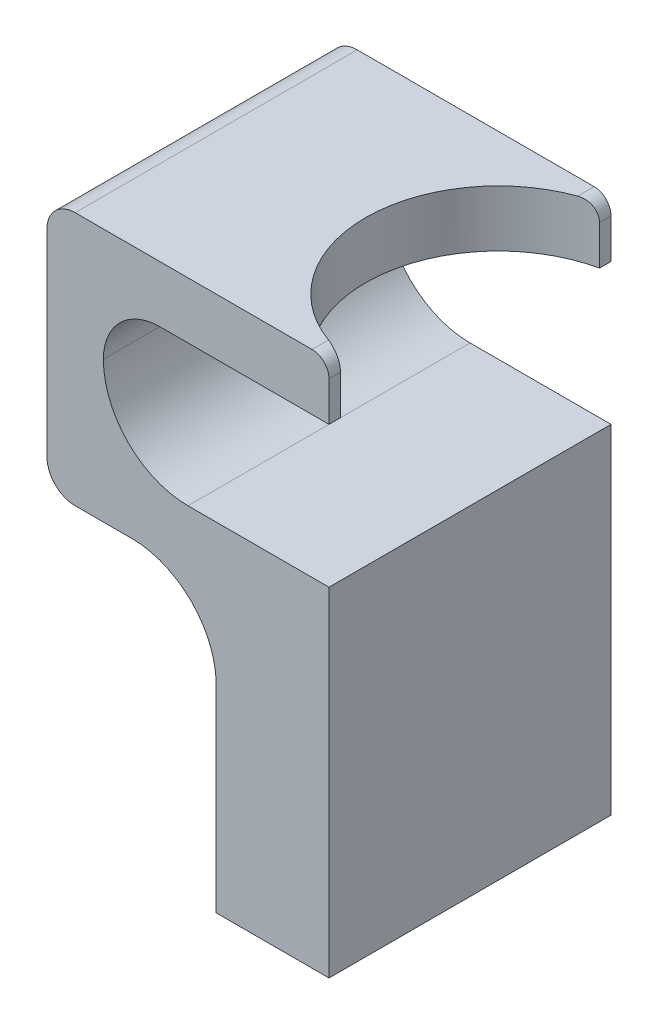
ISO-10303-21;
HEADER;
FILE_DESCRIPTION(('STEP AP214'),'2;1');
FILE_NAME('part.step','',(''),(''),'','','');
FILE_SCHEMA(('AUTOMOTIVE_DESIGN { 1 0 10303 214 1 1 1 1 }'));
ENDSEC;
DATA;
#1=APPLICATION_CONTEXT('core data for automotive mechanical design processes');
#2=APPLICATION_PROTOCOL_DEFINITION('international standard','automotive_design',2000,#1);
#3=PRODUCT_CONTEXT('',#1,'mechanical');
#4=PRODUCT('Part','Part','',(#3));
#5=PRODUCT_RELATED_PRODUCT_CATEGORY('part','',(#4));
#6=PRODUCT_DEFINITION_FORMATION('','',#4);
#7=PRODUCT_DEFINITION_CONTEXT('part definition',#1,'design');
#8=PRODUCT_DEFINITION('design','',#6,#7);
#9=PRODUCT_DEFINITION_SHAPE('','',#8);
#10=(LENGTH_UNIT() NAMED_UNIT(*) SI_UNIT(.MILLI.,.METRE.));
#11=(NAMED_UNIT(*) PLANE_ANGLE_UNIT() SI_UNIT($,.RADIAN.));
#12=(NAMED_UNIT(*) SI_UNIT($,.STERADIAN.) SOLID_ANGLE_UNIT());
#13=UNCERTAINTY_MEASURE_WITH_UNIT(LENGTH_MEASURE(1.E-05),#10,'distance_accuracy_value','');
#14=(GEOMETRIC_REPRESENTATION_CONTEXT(3) GLOBAL_UNCERTAINTY_ASSIGNED_CONTEXT((#13)) GLOBAL_UNIT_ASSIGNED_CONTEXT((#10,
#11,#12)) REPRESENTATION_CONTEXT('',''));
#15=CARTESIAN_POINT('',(0.,0.,0.));
#16=DIRECTION('',(0.,0.,1.));
#17=DIRECTION('',(1.,0.,0.));
#18=AXIS2_PLACEMENT_3D('',#15,#16,#17);
#19=CARTESIAN_POINT('',(20.,85.,50.));
#20=DIRECTION('',(-1.,0.,0.));
#21=DIRECTION('',(0.,0.,1.));
#22=AXIS2_PLACEMENT_3D('',#19,#20,#21);
#23=PLANE('',#22);
#24=DIRECTION('',(0.,1.,0.));
#25=VECTOR('',#24,1.);
#26=CARTESIAN_POINT('',(20.,75.,47.9619250064101));
#27=LINE('',#26,#25);
#28=CARTESIAN_POINT('',(20.,85.,47.9619250064101));
#29=VERTEX_POINT('',#28);
#30=CARTESIAN_POINT('',(20.,92.,47.9619250064101));
#31=VERTEX_POINT('',#30);
#32=EDGE_CURVE('E171',#29,#31,#27,.T.);
#33=ORIENTED_EDGE('',*,*,#32,.T.);
#34=DIRECTION('',(0.,0.,-1.));
#35=VECTOR('',#34,1.);
#36=CARTESIAN_POINT('',(20.,92.,50.));
#37=LINE('',#36,#35);
#38=CARTESIAN_POINT('',(20.,92.,50.));
#39=VERTEX_POINT('',#38);
#40=EDGE_CURVE('E305',#31,#39,#37,.F.);
#41=ORIENTED_EDGE('',*,*,#40,.T.);
#42=DIRECTION('',(0.,1.,0.));
#43=VECTOR('',#42,1.);
#44=CARTESIAN_POINT('',(20.,85.,50.));
#45=LINE('',#44,#43);
#46=CARTESIAN_POINT('',(20.,85.,50.));
#47=VERTEX_POINT('',#46);
#48=EDGE_CURVE('E341',#47,#39,#45,.T.);
#49=ORIENTED_EDGE('',*,*,#48,.F.);
#50=DIRECTION('',(0.,0.,-1.));
#51=VECTOR('',#50,1.);
#52=CARTESIAN_POINT('',(20.,85.,50.));
#53=LINE('',#52,#51);
#54=EDGE_CURVE('E179',#47,#29,#53,.T.);
#55=ORIENTED_EDGE('',*,*,#54,.T.);
#56=EDGE_LOOP('',(#33,#41,#49,#55));
#57=FACE_BOUND('',#56,.T.);
#58=ADVANCED_FACE('F32',(#57),#23,.F.);
#59=CARTESIAN_POINT('',(0.,0.,50.));
#60=DIRECTION('',(0.,1.,0.));
#61=DIRECTION('',(0.,0.,1.));
#62=AXIS2_PLACEMENT_3D('',#59,#60,#61);
#63=PLANE('',#62);
#64=DIRECTION('',(1.,0.,0.));
#65=VECTOR('',#64,1.);
#66=CARTESIAN_POINT('',(0.,0.,0.));
#67=LINE('',#66,#65);
#68=CARTESIAN_POINT('',(0.,0.,0.));
#69=VERTEX_POINT('',#68);
#70=CARTESIAN_POINT('',(20.,0.,0.));
#71=VERTEX_POINT('',#70);
#72=EDGE_CURVE('E307',#69,#71,#67,.T.);
#73=ORIENTED_EDGE('',*,*,#72,.T.);
#74=DIRECTION('',(0.,0.,-1.));
#75=VECTOR('',#74,1.);
#76=CARTESIAN_POINT('',(20.,0.,50.));
#77=LINE('',#76,#75);
#78=CARTESIAN_POINT('',(20.,0.,50.));
#79=VERTEX_POINT('',#78);
#80=EDGE_CURVE('E190',#79,#71,#77,.T.);
#81=ORIENTED_EDGE('',*,*,#80,.F.);
#82=DIRECTION('',(1.,0.,0.));
#83=VECTOR('',#82,1.);
#84=CARTESIAN_POINT('',(0.,0.,50.));
#85=LINE('',#84,#83);
#86=CARTESIAN_POINT('',(0.,0.,50.));
#87=VERTEX_POINT('',#86);
#88=EDGE_CURVE('E376',#87,#79,#85,.T.);
#89=ORIENTED_EDGE('',*,*,#88,.F.);
#90=DIRECTION('',(0.,0.,-1.));
#91=VECTOR('',#90,1.);
#92=CARTESIAN_POINT('',(0.,0.,50.));
#93=LINE('',#92,#91);
#94=EDGE_CURVE('E180',#87,#69,#93,.T.);
#95=ORIENTED_EDGE('',*,*,#94,.T.);
#96=EDGE_LOOP('',(#73,#81,#89,#95));
#97=FACE_BOUND('',#96,.T.);
#98=ADVANCED_FACE('F279',(#97),#63,.F.);
#99=CARTESIAN_POINT('',(20.,0.,50.));
#100=DIRECTION('',(-1.,0.,0.));
#101=DIRECTION('',(0.,0.,1.));
#102=AXIS2_PLACEMENT_3D('',#99,#100,#101);
#103=PLANE('',#102);
#104=DIRECTION('',(0.,1.,0.));
#105=VECTOR('',#104,1.);
#106=CARTESIAN_POINT('',(20.,0.,0.));
#107=LINE('',#106,#105);
#108=CARTESIAN_POINT('',(20.,60.,0.));
#109=VERTEX_POINT('',#108);
#110=EDGE_CURVE('E361',#71,#109,#107,.T.);
#111=ORIENTED_EDGE('',*,*,#110,.T.);
#112=DIRECTION('',(0.,0.,-1.));
#113=VECTOR('',#112,1.);
#114=CARTESIAN_POINT('',(20.,60.,50.));
#115=LINE('',#114,#113);
#116=CARTESIAN_POINT('',(20.,60.,50.));
#117=VERTEX_POINT('',#116);
#118=EDGE_CURVE('E182',#117,#109,#115,.T.);
#119=ORIENTED_EDGE('',*,*,#118,.F.);
#120=DIRECTION('',(0.,1.,0.));
#121=VECTOR('',#120,1.);
#122=CARTESIAN_POINT('',(20.,0.,50.));
#123=LINE('',#122,#121);
#124=EDGE_CURVE('E347',#79,#117,#123,.T.);
#125=ORIENTED_EDGE('',*,*,#124,.F.);
#126=ORIENTED_EDGE('',*,*,#80,.T.);
#127=EDGE_LOOP('',(#111,#119,#125,#126));
#128=FACE_BOUND('',#127,.T.);
#129=ADVANCED_FACE('F275',(#128),#103,.F.);
#130=CARTESIAN_POINT('',(20.,60.,50.));
#131=DIRECTION('',(0.,-1.,0.));
#132=DIRECTION('',(1.,0.,0.));
#133=AXIS2_PLACEMENT_3D('',#130,#131,#132);
#134=PLANE('',#133);
#135=DIRECTION('',(-1.,0.,0.));
#136=VECTOR('',#135,1.);
#137=CARTESIAN_POINT('',(20.,60.,0.));
#138=LINE('',#137,#136);
#139=CARTESIAN_POINT('',(-5.,60.,0.));
#140=VERTEX_POINT('',#139);
#141=EDGE_CURVE('E363',#109,#140,#138,.T.);
#142=ORIENTED_EDGE('',*,*,#141,.T.);
#143=DIRECTION('',(0.,0.,-1.));
#144=VECTOR('',#143,1.);
#145=CARTESIAN_POINT('',(-5.,60.,50.));
#146=LINE('',#145,#144);
#147=CARTESIAN_POINT('',(-5.,60.,50.));
#148=VERTEX_POINT('',#147);
#149=EDGE_CURVE('E198',#140,#148,#146,.F.);
#150=ORIENTED_EDGE('',*,*,#149,.T.);
#151=DIRECTION('',(-1.,0.,0.));
#152=VECTOR('',#151,1.);
#153=CARTESIAN_POINT('',(20.,60.,50.));
#154=LINE('',#153,#152);
#155=EDGE_CURVE('E342',#117,#148,#154,.T.);
#156=ORIENTED_EDGE('',*,*,#155,.F.);
#157=ORIENTED_EDGE('',*,*,#118,.T.);
#158=EDGE_LOOP('',(#142,#150,#156,#157));
#159=FACE_BOUND('',#158,.T.);
#160=ADVANCED_FACE('F272',(#159),#134,.F.);
#161=CARTESIAN_POINT('',(-20.,85.,50.));
#162=DIRECTION('',(0.,1.,0.));
#163=DIRECTION('',(0.,0.,1.));
#164=AXIS2_PLACEMENT_3D('',#161,#162,#163);
#165=PLANE('',#164);
#166=DIRECTION('',(1.,0.,0.));
#167=VECTOR('',#166,1.);
#168=CARTESIAN_POINT('',(-20.,85.,50.));
#169=LINE('',#168,#167);
#170=CARTESIAN_POINT('',(-10.,85.,50.));
#171=VERTEX_POINT('',#170);
#172=EDGE_CURVE('E340',#171,#47,#169,.T.);
#173=ORIENTED_EDGE('',*,*,#172,.F.);
#174=DIRECTION('',(0.,0.,-1.));
#175=VECTOR('',#174,1.);
#176=CARTESIAN_POINT('',(-10.,85.,0.));
#177=LINE('',#176,#175);
#178=CARTESIAN_POINT('',(-10.,85.,0.));
#179=VERTEX_POINT('',#178);
#180=EDGE_CURVE('E332',#171,#179,#177,.T.);
#181=ORIENTED_EDGE('',*,*,#180,.T.);
#182=DIRECTION('',(1.,0.,0.));
#183=VECTOR('',#182,1.);
#184=CARTESIAN_POINT('',(-20.,85.,0.));
#185=LINE('',#184,#183);
#186=CARTESIAN_POINT('',(20.,85.,0.));
#187=VERTEX_POINT('',#186);
#188=EDGE_CURVE('E178',#179,#187,#185,.T.);
#189=ORIENTED_EDGE('',*,*,#188,.T.);
#190=CARTESIAN_POINT('',(20.,85.,2.03807499358991));
#191=VERTEX_POINT('',#190);
#192=EDGE_CURVE('E160',#191,#187,#53,.T.);
#193=ORIENTED_EDGE('',*,*,#192,.F.);
#194=CARTESIAN_POINT('',(25.,85.,25.));
#195=DIRECTION('',(0.,1.,0.));
#196=DIRECTION('',(0.,0.,1.));
#197=AXIS2_PLACEMENT_3D('',#194,#195,#196);
#198=CIRCLE('',#197,23.5);
#199=EDGE_CURVE('E166',#191,#29,#198,.T.);
#200=ORIENTED_EDGE('',*,*,#199,.T.);
#201=ORIENTED_EDGE('',*,*,#54,.F.);
#202=EDGE_LOOP('',(#173,#181,#189,#193,#200,#201));
#203=FACE_BOUND('',#202,.T.);
#204=ADVANCED_FACE('F176',(#203),#165,.F.);
#205=DIRECTION('',(0.,1.,0.));
#206=VECTOR('',#205,1.);
#207=CARTESIAN_POINT('',(20.,85.,0.));
#208=LINE('',#207,#206);
#209=CARTESIAN_POINT('',(20.,92.,0.));
#210=VERTEX_POINT('',#209);
#211=EDGE_CURVE('E366',#187,#210,#208,.T.);
#212=ORIENTED_EDGE('',*,*,#211,.T.);
#213=DIRECTION('',(0.,0.,-1.));
#214=VECTOR('',#213,1.);
#215=CARTESIAN_POINT('',(20.,92.,50.));
#216=LINE('',#215,#214);
#217=CARTESIAN_POINT('',(20.,92.,2.03807499358991));
#218=VERTEX_POINT('',#217);
#219=EDGE_CURVE('E163',#210,#218,#216,.F.);
#220=ORIENTED_EDGE('',*,*,#219,.T.);
#221=DIRECTION('',(0.,1.,0.));
#222=VECTOR('',#221,1.);
#223=CARTESIAN_POINT('',(20.,75.,2.03807499358991));
#224=LINE('',#223,#222);
#225=EDGE_CURVE('E155',#218,#191,#224,.F.);
#226=ORIENTED_EDGE('',*,*,#225,.T.);
#227=ORIENTED_EDGE('',*,*,#192,.T.);
#228=EDGE_LOOP('',(#212,#220,#226,#227));
#229=FACE_BOUND('',#228,.T.);
#230=ADVANCED_FACE('F158',(#229),#23,.F.);
#231=CARTESIAN_POINT('',(20.,95.,50.));
#232=DIRECTION('',(0.,-1.,0.));
#233=DIRECTION('',(0.,0.,-1.));
#234=AXIS2_PLACEMENT_3D('',#231,#232,#233);
#235=PLANE('',#234);
#236=DIRECTION('',(-1.,0.,0.));
#237=VECTOR('',#236,1.);
#238=CARTESIAN_POINT('',(20.,95.,0.));
#239=LINE('',#238,#237);
#240=CARTESIAN_POINT('',(17.,95.,0.));
#241=VERTEX_POINT('',#240);
#242=CARTESIAN_POINT('',(-25.,95.,0.));
#243=VERTEX_POINT('',#242);
#244=EDGE_CURVE('E368',#241,#243,#239,.T.);
#245=ORIENTED_EDGE('',*,*,#244,.T.);
#246=DIRECTION('',(0.,0.,-1.));
#247=VECTOR('',#246,1.);
#248=CARTESIAN_POINT('',(-25.,95.,50.));
#249=LINE('',#248,#247);
#250=CARTESIAN_POINT('',(-25.,95.,50.));
#251=VERTEX_POINT('',#250);
#252=EDGE_CURVE('E323',#243,#251,#249,.F.);
#253=ORIENTED_EDGE('',*,*,#252,.T.);
#254=DIRECTION('',(-1.,0.,0.));
#255=VECTOR('',#254,1.);
#256=CARTESIAN_POINT('',(20.,95.,50.));
#257=LINE('',#256,#255);
#258=CARTESIAN_POINT('',(17.,95.,50.));
#259=VERTEX_POINT('',#258);
#260=EDGE_CURVE('E344',#259,#251,#257,.T.);
#261=ORIENTED_EDGE('',*,*,#260,.F.);
#262=DIRECTION('',(0.,0.,-1.));
#263=VECTOR('',#262,1.);
#264=CARTESIAN_POINT('',(17.,95.,50.));
#265=LINE('',#264,#263);
#266=CARTESIAN_POINT('',(17.,95.,47.0963797939844));
#267=VERTEX_POINT('',#266);
#268=EDGE_CURVE('E215',#259,#267,#265,.T.);
#269=ORIENTED_EDGE('',*,*,#268,.T.);
#270=CARTESIAN_POINT('',(25.,95.,25.));
#271=DIRECTION('',(0.,-1.,0.));
#272=DIRECTION('',(0.,0.,-1.));
#273=AXIS2_PLACEMENT_3D('',#270,#271,#272);
#274=CIRCLE('',#273,23.5);
#275=CARTESIAN_POINT('',(17.,95.,2.90362020601562));
#276=VERTEX_POINT('',#275);
#277=EDGE_CURVE('E193',#267,#276,#274,.T.);
#278=ORIENTED_EDGE('',*,*,#277,.T.);
#279=DIRECTION('',(0.,0.,-1.));
#280=VECTOR('',#279,1.);
#281=CARTESIAN_POINT('',(17.,95.,50.));
#282=LINE('',#281,#280);
#283=EDGE_CURVE('E218',#276,#241,#282,.T.);
#284=ORIENTED_EDGE('',*,*,#283,.T.);
#285=EDGE_LOOP('',(#245,#253,#261,#269,#278,#284));
#286=FACE_BOUND('',#285,.T.);
#287=ADVANCED_FACE('F263',(#286),#235,.F.);
#288=CARTESIAN_POINT('',(-30.,95.,50.));
#289=DIRECTION('',(1.,0.,0.));
#290=DIRECTION('',(0.,1.,0.));
#291=AXIS2_PLACEMENT_3D('',#288,#289,#290);
#292=PLANE('',#291);
#293=DIRECTION('',(0.,-1.,0.));
#294=VECTOR('',#293,1.);
#295=CARTESIAN_POINT('',(-30.,95.,50.));
#296=LINE('',#295,#294);
#297=CARTESIAN_POINT('',(-30.,90.,50.));
#298=VERTEX_POINT('',#297);
#299=CARTESIAN_POINT('',(-30.,55.,50.));
#300=VERTEX_POINT('',#299);
#301=EDGE_CURVE('E353',#298,#300,#296,.T.);
#302=ORIENTED_EDGE('',*,*,#301,.F.);
#303=DIRECTION('',(0.,0.,-1.));
#304=VECTOR('',#303,1.);
#305=CARTESIAN_POINT('',(-30.,90.,50.));
#306=LINE('',#305,#304);
#307=CARTESIAN_POINT('',(-30.,90.,0.));
#308=VERTEX_POINT('',#307);
#309=EDGE_CURVE('E316',#298,#308,#306,.T.);
#310=ORIENTED_EDGE('',*,*,#309,.T.);
#311=DIRECTION('',(0.,-1.,0.));
#312=VECTOR('',#311,1.);
#313=CARTESIAN_POINT('',(-30.,95.,0.));
#314=LINE('',#313,#312);
#315=CARTESIAN_POINT('',(-30.,55.,0.));
#316=VERTEX_POINT('',#315);
#317=EDGE_CURVE('E371',#308,#316,#314,.T.);
#318=ORIENTED_EDGE('',*,*,#317,.T.);
#319=DIRECTION('',(0.,0.,-1.));
#320=VECTOR('',#319,1.);
#321=CARTESIAN_POINT('',(-30.,55.,50.));
#322=LINE('',#321,#320);
#323=EDGE_CURVE('E312',#316,#300,#322,.F.);
#324=ORIENTED_EDGE('',*,*,#323,.T.);
#325=EDGE_LOOP('',(#302,#310,#318,#324));
#326=FACE_BOUND('',#325,.T.);
#327=ADVANCED_FACE('F259',(#326),#292,.F.);
#328=CARTESIAN_POINT('',(-30.,50.,50.));
#329=DIRECTION('',(0.,1.,0.));
#330=DIRECTION('',(0.,0.,1.));
#331=AXIS2_PLACEMENT_3D('',#328,#329,#330);
#332=PLANE('',#331);
#333=DIRECTION('',(1.,0.,0.));
#334=VECTOR('',#333,1.);
#335=CARTESIAN_POINT('',(-30.,50.,50.));
#336=LINE('',#335,#334);
#337=CARTESIAN_POINT('',(-25.,50.,50.));
#338=VERTEX_POINT('',#337);
#339=CARTESIAN_POINT('',(-15.,50.,50.));
#340=VERTEX_POINT('',#339);
#341=EDGE_CURVE('E356',#338,#340,#336,.T.);
#342=ORIENTED_EDGE('',*,*,#341,.F.);
#343=DIRECTION('',(0.,0.,-1.));
#344=VECTOR('',#343,1.);
#345=CARTESIAN_POINT('',(-25.,50.,50.));
#346=LINE('',#345,#344);
#347=CARTESIAN_POINT('',(-25.,50.,0.));
#348=VERTEX_POINT('',#347);
#349=EDGE_CURVE('E329',#338,#348,#346,.T.);
#350=ORIENTED_EDGE('',*,*,#349,.T.);
#351=DIRECTION('',(1.,0.,0.));
#352=VECTOR('',#351,1.);
#353=CARTESIAN_POINT('',(-30.,50.,0.));
#354=LINE('',#353,#352);
#355=CARTESIAN_POINT('',(-15.,50.,0.));
#356=VERTEX_POINT('',#355);
#357=EDGE_CURVE('E374',#348,#356,#354,.T.);
#358=ORIENTED_EDGE('',*,*,#357,.T.);
#359=DIRECTION('',(0.,0.,-1.));
#360=VECTOR('',#359,1.);
#361=CARTESIAN_POINT('',(-15.,50.,50.));
#362=LINE('',#361,#360);
#363=EDGE_CURVE('E203',#356,#340,#362,.F.);
#364=ORIENTED_EDGE('',*,*,#363,.T.);
#365=EDGE_LOOP('',(#342,#350,#358,#364));
#366=FACE_BOUND('',#365,.T.);
#367=ADVANCED_FACE('F255',(#366),#332,.F.);
#368=CARTESIAN_POINT('',(0.,50.,50.));
#369=DIRECTION('',(1.,0.,0.));
#370=DIRECTION('',(0.,0.,-1.));
#371=AXIS2_PLACEMENT_3D('',#368,#369,#370);
#372=PLANE('',#371);
#373=DIRECTION('',(0.,-1.,0.));
#374=VECTOR('',#373,1.);
#375=CARTESIAN_POINT('',(0.,50.,50.));
#376=LINE('',#375,#374);
#377=CARTESIAN_POINT('',(0.,35.,50.));
#378=VERTEX_POINT('',#377);
#379=EDGE_CURVE('E184',#378,#87,#376,.T.);
#380=ORIENTED_EDGE('',*,*,#379,.F.);
#381=DIRECTION('',(0.,0.,-1.));
#382=VECTOR('',#381,1.);
#383=CARTESIAN_POINT('',(0.,35.,0.));
#384=LINE('',#383,#382);
#385=CARTESIAN_POINT('',(0.,35.,0.));
#386=VERTEX_POINT('',#385);
#387=EDGE_CURVE('E200',#378,#386,#384,.T.);
#388=ORIENTED_EDGE('',*,*,#387,.T.);
#389=DIRECTION('',(0.,-1.,0.));
#390=VECTOR('',#389,1.);
#391=CARTESIAN_POINT('',(0.,50.,0.));
#392=LINE('',#391,#390);
#393=EDGE_CURVE('E375',#386,#69,#392,.T.);
#394=ORIENTED_EDGE('',*,*,#393,.T.);
#395=ORIENTED_EDGE('',*,*,#94,.F.);
#396=EDGE_LOOP('',(#380,#388,#394,#395));
#397=FACE_BOUND('',#396,.T.);
#398=ADVANCED_FACE('F249',(#397),#372,.F.);
#399=CARTESIAN_POINT('',(0.,0.,50.));
#400=DIRECTION('',(0.,0.,1.));
#401=DIRECTION('',(1.,0.,0.));
#402=AXIS2_PLACEMENT_3D('',#399,#400,#401);
#403=PLANE('',#402);
#404=ORIENTED_EDGE('',*,*,#260,.T.);
#405=CARTESIAN_POINT('',(-25.,90.,50.));
#406=DIRECTION('',(0.,0.,1.));
#407=DIRECTION('',(1.,0.,0.));
#408=AXIS2_PLACEMENT_3D('',#405,#406,#407);
#409=CIRCLE('',#408,5.);
#410=EDGE_CURVE('E327',#251,#298,#409,.T.);
#411=ORIENTED_EDGE('',*,*,#410,.T.);
#412=ORIENTED_EDGE('',*,*,#301,.T.);
#413=CARTESIAN_POINT('',(-25.,55.,50.));
#414=DIRECTION('',(0.,0.,1.));
#415=DIRECTION('',(1.,0.,0.));
#416=AXIS2_PLACEMENT_3D('',#413,#414,#415);
#417=CIRCLE('',#416,5.);
#418=EDGE_CURVE('E325',#300,#338,#417,.T.);
#419=ORIENTED_EDGE('',*,*,#418,.T.);
#420=ORIENTED_EDGE('',*,*,#341,.T.);
#421=CARTESIAN_POINT('',(-15.,35.,50.));
#422=DIRECTION('',(0.,0.,1.));
#423=DIRECTION('',(1.,0.,0.));
#424=AXIS2_PLACEMENT_3D('',#421,#422,#423);
#425=CIRCLE('',#424,15.);
#426=EDGE_CURVE('E213',#340,#378,#425,.F.);
#427=ORIENTED_EDGE('',*,*,#426,.T.);
#428=ORIENTED_EDGE('',*,*,#379,.T.);
#429=ORIENTED_EDGE('',*,*,#88,.T.);
#430=ORIENTED_EDGE('',*,*,#124,.T.);
#431=ORIENTED_EDGE('',*,*,#155,.T.);
#432=CARTESIAN_POINT('',(-5.,75.,50.));
#433=DIRECTION('',(0.,0.,1.));
#434=DIRECTION('',(1.,0.,0.));
#435=AXIS2_PLACEMENT_3D('',#432,#433,#434);
#436=CIRCLE('',#435,15.);
#437=CARTESIAN_POINT('',(-20.,75.,50.));
#438=VERTEX_POINT('',#437);
#439=EDGE_CURVE('E208',#148,#438,#436,.F.);
#440=ORIENTED_EDGE('',*,*,#439,.T.);
#441=CARTESIAN_POINT('',(-10.,75.,50.));
#442=DIRECTION('',(0.,0.,1.));
#443=DIRECTION('',(1.,0.,0.));
#444=AXIS2_PLACEMENT_3D('',#441,#442,#443);
#445=CIRCLE('',#444,10.);
#446=EDGE_CURVE('E11',#438,#171,#445,.F.);
#447=ORIENTED_EDGE('',*,*,#446,.T.);
#448=ORIENTED_EDGE('',*,*,#172,.T.);
#449=ORIENTED_EDGE('',*,*,#48,.T.);
#450=CARTESIAN_POINT('',(17.,92.,50.));
#451=DIRECTION('',(0.,0.,1.));
#452=DIRECTION('',(1.,0.,0.));
#453=AXIS2_PLACEMENT_3D('',#450,#451,#452);
#454=CIRCLE('',#453,3.);
#455=EDGE_CURVE('E311',#39,#259,#454,.T.);
#456=ORIENTED_EDGE('',*,*,#455,.T.);
#457=EDGE_LOOP('',(#404,#411,#412,#419,#420,#427,#428,#429,#430,#431,#440,#447,#448,#449,#456));
#458=FACE_BOUND('',#457,.T.);
#459=ADVANCED_FACE('F245',(#458),#403,.T.);
#460=CARTESIAN_POINT('',(0.,0.,0.));
#461=DIRECTION('',(0.,0.,1.));
#462=DIRECTION('',(1.,0.,0.));
#463=AXIS2_PLACEMENT_3D('',#460,#461,#462);
#464=PLANE('',#463);
#465=ORIENTED_EDGE('',*,*,#317,.F.);
#466=CARTESIAN_POINT('',(-25.,90.,0.));
#467=DIRECTION('',(0.,0.,1.));
#468=DIRECTION('',(1.,0.,0.));
#469=AXIS2_PLACEMENT_3D('',#466,#467,#468);
#470=CIRCLE('',#469,5.);
#471=EDGE_CURVE('E321',#308,#243,#470,.F.);
#472=ORIENTED_EDGE('',*,*,#471,.T.);
#473=ORIENTED_EDGE('',*,*,#244,.F.);
#474=CARTESIAN_POINT('',(17.,92.,0.));
#475=DIRECTION('',(0.,0.,1.));
#476=DIRECTION('',(1.,0.,0.));
#477=AXIS2_PLACEMENT_3D('',#474,#475,#476);
#478=CIRCLE('',#477,3.);
#479=EDGE_CURVE('E221',#241,#210,#478,.F.);
#480=ORIENTED_EDGE('',*,*,#479,.T.);
#481=ORIENTED_EDGE('',*,*,#211,.F.);
#482=ORIENTED_EDGE('',*,*,#188,.F.);
#483=CARTESIAN_POINT('',(-10.,75.,0.));
#484=DIRECTION('',(0.,0.,1.));
#485=DIRECTION('',(1.,0.,0.));
#486=AXIS2_PLACEMENT_3D('',#483,#484,#485);
#487=CIRCLE('',#486,10.);
#488=CARTESIAN_POINT('',(-20.,75.,0.));
#489=VERTEX_POINT('',#488);
#490=EDGE_CURVE('E40',#179,#489,#487,.T.);
#491=ORIENTED_EDGE('',*,*,#490,.T.);
#492=CARTESIAN_POINT('',(-5.,75.,0.));
#493=DIRECTION('',(0.,0.,1.));
#494=DIRECTION('',(1.,0.,0.));
#495=AXIS2_PLACEMENT_3D('',#492,#493,#494);
#496=CIRCLE('',#495,15.);
#497=EDGE_CURVE('E206',#489,#140,#496,.T.);
#498=ORIENTED_EDGE('',*,*,#497,.T.);
#499=ORIENTED_EDGE('',*,*,#141,.F.);
#500=ORIENTED_EDGE('',*,*,#110,.F.);
#501=ORIENTED_EDGE('',*,*,#72,.F.);
#502=ORIENTED_EDGE('',*,*,#393,.F.);
#503=CARTESIAN_POINT('',(-15.,35.,0.));
#504=DIRECTION('',(0.,0.,1.));
#505=DIRECTION('',(1.,0.,0.));
#506=AXIS2_PLACEMENT_3D('',#503,#504,#505);
#507=CIRCLE('',#506,15.);
#508=EDGE_CURVE('E210',#386,#356,#507,.T.);
#509=ORIENTED_EDGE('',*,*,#508,.T.);
#510=ORIENTED_EDGE('',*,*,#357,.F.);
#511=CARTESIAN_POINT('',(-25.,55.,0.));
#512=DIRECTION('',(0.,0.,1.));
#513=DIRECTION('',(1.,0.,0.));
#514=AXIS2_PLACEMENT_3D('',#511,#512,#513);
#515=CIRCLE('',#514,5.);
#516=EDGE_CURVE('E319',#348,#316,#515,.F.);
#517=ORIENTED_EDGE('',*,*,#516,.T.);
#518=EDGE_LOOP('',(#465,#472,#473,#480,#481,#482,#491,#498,#499,#500,#501,#502,#509,#510,#517));
#519=FACE_BOUND('',#518,.T.);
#520=ADVANCED_FACE('F244',(#519),#464,.F.);
#521=CARTESIAN_POINT('',(25.,75.,25.));
#522=DIRECTION('',(0.,1.,0.));
#523=DIRECTION('',(-1.,0.,0.));
#524=AXIS2_PLACEMENT_3D('',#521,#522,#523);
#525=CYLINDRICAL_SURFACE('',#524,23.5);
#526=ORIENTED_EDGE('',*,*,#225,.F.);
#527=CARTESIAN_POINT('',(20.,92.,2.03807499358991));
#528=CARTESIAN_POINT('',(20.0000090030676,92.0827130226725,2.03807638189903));
#529=CARTESIAN_POINT('',(19.9965793533691,92.1654220322075,2.03881993277698));
#530=CARTESIAN_POINT('',(19.9829119412785,92.3302430352799,2.04180065833342));
#531=CARTESIAN_POINT('',(19.9726746442636,92.4123550692392,2.04403773091341));
#532=CARTESIAN_POINT('',(19.9454766370268,92.5753115851667,2.05001138648529));
#533=CARTESIAN_POINT('',(19.9285236110107,92.6561574064256,2.05374625574301));
#534=CARTESIAN_POINT('',(19.8880495289188,92.8160779374195,2.06272927862515));
#535=CARTESIAN_POINT('',(19.8645285323027,92.8951526631811,2.06797741854996));
#536=CARTESIAN_POINT('',(19.7843432294037,93.1289438117784,2.08603101975693));
#537=CARTESIAN_POINT('',(19.7180427331003,93.2803096453523,2.10114859656409));
#538=CARTESIAN_POINT('',(19.5619968630363,93.5694590919721,2.1377057780541));
#539=CARTESIAN_POINT('',(19.4722534675273,93.7072438497195,2.15914484931122));
#540=CARTESIAN_POINT('',(19.2716331538034,93.9663838342551,2.20863066410226));
#541=CARTESIAN_POINT('',(19.160641095775,94.0876430860687,2.23671361377257));
#542=CARTESIAN_POINT('',(18.9214180883445,94.3097189435302,2.29942505985077));
#543=CARTESIAN_POINT('',(18.7931856557322,94.4105337884474,2.33405411953259));
#544=CARTESIAN_POINT('',(18.5206994366157,94.5912835504494,2.4104214052659));
#545=CARTESIAN_POINT('',(18.3761714550993,94.6707488816054,2.45229062978487));
#546=CARTESIAN_POINT('',(18.0776477622844,94.8045384404262,2.54214320035069));
#547=CARTESIAN_POINT('',(17.9236494867222,94.8588558245449,2.59012820616843));
#548=CARTESIAN_POINT('',(17.6410472468166,94.9336138212672,2.6815468311457));
#549=CARTESIAN_POINT('',(17.5133136886406,94.9585826197185,2.72405703662234));
#550=CARTESIAN_POINT('',(17.2569102587284,94.9917749302935,2.8118684725799));
#551=CARTESIAN_POINT('',(17.1282426814107,95.0000308021156,2.85716413419518));
#552=CARTESIAN_POINT('',(17.,95.,2.90362020601562));
#553=B_SPLINE_CURVE_WITH_KNOTS('',3,(#527,#528,#529,#530,#531,#532,#533,#534,#535,#536,#537,
#538,#539,#540,#541,#542,#543,#544,#545,#546,#547,#548,#549,#550,#551,#552),.UNSPECIFIED.,.F.,
.F.,(4,2,2,2,2,2,2,2,2,2,2,2,4),(0.,0.248057481724408,0.496098007750695,0.743855539254303,
0.991610827887081,1.48687361753381,1.98209462744866,2.4800791930441,2.97810662829881,
3.48632729662519,3.9946861865803,4.40440831064734,4.81333636586334),.UNSPECIFIED.);
#554=EDGE_CURVE('E231',#218,#276,#553,.T.);
#555=ORIENTED_EDGE('',*,*,#554,.T.);
#556=ORIENTED_EDGE('',*,*,#277,.F.);
#557=CARTESIAN_POINT('',(17.,95.,47.0963797939844));
#558=CARTESIAN_POINT('',(17.0852889084119,95.0000060421702,47.1272638202849));
#559=CARTESIAN_POINT('',(17.170764462204,94.9963625580913,47.1576466459614));
#560=CARTESIAN_POINT('',(17.3415160031369,94.9817281673848,47.2172397605302));
#561=CARTESIAN_POINT('',(17.4267919396638,94.9707355651445,47.2464497771789));
#562=CARTESIAN_POINT('',(17.5966474194459,94.941334451806,47.30355169767));
#563=CARTESIAN_POINT('',(17.6812258521345,94.9229158297198,47.3314417462067));
#564=CARTESIAN_POINT('',(17.8488949564661,94.878698627408,47.3856981017662));
#565=CARTESIAN_POINT('',(17.9319857555644,94.8529006826639,47.4120645397621));
#566=CARTESIAN_POINT('',(18.1783881280664,94.7643844443644,47.488776890215));
#567=CARTESIAN_POINT('',(18.3386525915076,94.6905740284442,47.5366766111973));
#568=CARTESIAN_POINT('',(18.6450281587316,94.5149662081993,47.6249822712217));
#569=CARTESIAN_POINT('',(18.791153458577,94.4131972775754,47.6653957647038));
#570=CARTESIAN_POINT('',(19.0586727614937,94.1888555864976,47.7369533738254));
#571=CARTESIAN_POINT('',(19.1808277092812,94.067290078387,47.7684061505119));
#572=CARTESIAN_POINT('',(19.40318455869,93.8039928514906,47.8240847237983));
#573=CARTESIAN_POINT('',(19.5033816306912,93.6622567074716,47.8483089309021));
#574=CARTESIAN_POINT('',(19.6750958102063,93.3681569216822,47.8889259804003));
#575=CARTESIAN_POINT('',(19.7474975210328,93.2163422385944,47.9055642502046));
#576=CARTESIAN_POINT('',(19.8659953062646,92.9023126128212,47.9324163846605));
#577=CARTESIAN_POINT('',(19.9121162086721,92.7401076477728,47.9426363137817));
#578=CARTESIAN_POINT('',(19.9628507954652,92.4804791023765,47.9538116177179));
#579=CARTESIAN_POINT('',(19.9767758439247,92.3848662173205,47.9568588009165));
#580=CARTESIAN_POINT('',(19.9953463378213,92.1928505500716,47.9609119053967));
#581=CARTESIAN_POINT('',(20.0000061430006,92.0964492230831,47.961920985472));
#582=CARTESIAN_POINT('',(20.,92.,47.9619250064101));
#583=B_SPLINE_CURVE_WITH_KNOTS('',3,(#557,#558,#559,#560,#561,#562,#563,#564,#565,#566,#567,
#568,#569,#570,#571,#572,#573,#574,#575,#576,#577,#578,#579,#580,#581,#582),.UNSPECIFIED.,.F.,
.F.,(4,2,2,2,2,2,2,2,2,2,2,2,4),(0.,0.272056384134419,0.544175559691533,0.81666650045722,
1.08913398231454,1.63462913437209,2.17957078593027,2.70248413401142,3.22551238135417,
3.73014897433164,4.23430803330379,4.52389288389855,4.81302857033273),.UNSPECIFIED.);
#584=EDGE_CURVE('E224',#267,#31,#583,.T.);
#585=ORIENTED_EDGE('',*,*,#584,.T.);
#586=ORIENTED_EDGE('',*,*,#32,.F.);
#587=ORIENTED_EDGE('',*,*,#199,.F.);
#588=EDGE_LOOP('',(#526,#555,#556,#585,#586,#587));
#589=FACE_BOUND('',#588,.T.);
#590=ADVANCED_FACE('F169',(#589),#525,.F.);
#591=CARTESIAN_POINT('',(-5.,75.,50.));
#592=DIRECTION('',(0.,0.,1.));
#593=DIRECTION('',(1.,0.,0.));
#594=AXIS2_PLACEMENT_3D('',#591,#592,#593);
#595=CYLINDRICAL_SURFACE('',#594,15.);
#596=ORIENTED_EDGE('',*,*,#439,.F.);
#597=ORIENTED_EDGE('',*,*,#149,.F.);
#598=ORIENTED_EDGE('',*,*,#497,.F.);
#599=DIRECTION('',(0.,0.,-1.));
#600=VECTOR('',#599,1.);
#601=CARTESIAN_POINT('',(-20.,75.,0.));
#602=LINE('',#601,#600);
#603=EDGE_CURVE('E196',#438,#489,#602,.T.);
#604=ORIENTED_EDGE('',*,*,#603,.F.);
#605=EDGE_LOOP('',(#596,#597,#598,#604));
#606=FACE_BOUND('',#605,.T.);
#607=ADVANCED_FACE('F243',(#606),#595,.F.);
#608=CARTESIAN_POINT('',(-15.,35.,50.));
#609=DIRECTION('',(0.,0.,1.));
#610=DIRECTION('',(1.,0.,0.));
#611=AXIS2_PLACEMENT_3D('',#608,#609,#610);
#612=CYLINDRICAL_SURFACE('',#611,15.);
#613=ORIENTED_EDGE('',*,*,#426,.F.);
#614=ORIENTED_EDGE('',*,*,#363,.F.);
#615=ORIENTED_EDGE('',*,*,#508,.F.);
#616=ORIENTED_EDGE('',*,*,#387,.F.);
#617=EDGE_LOOP('',(#613,#614,#615,#616));
#618=FACE_BOUND('',#617,.T.);
#619=ADVANCED_FACE('F286',(#618),#612,.F.);
#620=CARTESIAN_POINT('',(17.,92.,50.));
#621=DIRECTION('',(0.,0.,-1.));
#622=DIRECTION('',(-1.,0.,0.));
#623=AXIS2_PLACEMENT_3D('',#620,#621,#622);
#624=CYLINDRICAL_SURFACE('',#623,3.);
#625=ORIENTED_EDGE('',*,*,#554,.F.);
#626=ORIENTED_EDGE('',*,*,#219,.F.);
#627=ORIENTED_EDGE('',*,*,#479,.F.);
#628=ORIENTED_EDGE('',*,*,#283,.F.);
#629=EDGE_LOOP('',(#625,#626,#627,#628));
#630=FACE_BOUND('',#629,.T.);
#631=ADVANCED_FACE('F289',(#630),#624,.T.);
#632=CARTESIAN_POINT('',(17.,92.,50.));
#633=DIRECTION('',(0.,0.,-1.));
#634=DIRECTION('',(-1.,0.,0.));
#635=AXIS2_PLACEMENT_3D('',#632,#633,#634);
#636=CYLINDRICAL_SURFACE('',#635,3.);
#637=ORIENTED_EDGE('',*,*,#455,.F.);
#638=ORIENTED_EDGE('',*,*,#40,.F.);
#639=ORIENTED_EDGE('',*,*,#584,.F.);
#640=ORIENTED_EDGE('',*,*,#268,.F.);
#641=EDGE_LOOP('',(#637,#638,#639,#640));
#642=FACE_BOUND('',#641,.T.);
#643=ADVANCED_FACE('F237',(#642),#636,.T.);
#644=CARTESIAN_POINT('',(-25.,90.,50.));
#645=DIRECTION('',(0.,0.,-1.));
#646=DIRECTION('',(-1.,0.,0.));
#647=AXIS2_PLACEMENT_3D('',#644,#645,#646);
#648=CYLINDRICAL_SURFACE('',#647,5.);
#649=ORIENTED_EDGE('',*,*,#410,.F.);
#650=ORIENTED_EDGE('',*,*,#252,.F.);
#651=ORIENTED_EDGE('',*,*,#471,.F.);
#652=ORIENTED_EDGE('',*,*,#309,.F.);
#653=EDGE_LOOP('',(#649,#650,#651,#652));
#654=FACE_BOUND('',#653,.T.);
#655=ADVANCED_FACE('F297',(#654),#648,.T.);
#656=CARTESIAN_POINT('',(-25.,55.,50.));
#657=DIRECTION('',(0.,0.,-1.));
#658=DIRECTION('',(-1.,0.,0.));
#659=AXIS2_PLACEMENT_3D('',#656,#657,#658);
#660=CYLINDRICAL_SURFACE('',#659,5.);
#661=ORIENTED_EDGE('',*,*,#418,.F.);
#662=ORIENTED_EDGE('',*,*,#323,.F.);
#663=ORIENTED_EDGE('',*,*,#516,.F.);
#664=ORIENTED_EDGE('',*,*,#349,.F.);
#665=EDGE_LOOP('',(#661,#662,#663,#664));
#666=FACE_BOUND('',#665,.T.);
#667=ADVANCED_FACE('F395',(#666),#660,.T.);
#668=CARTESIAN_POINT('',(-10.,75.,50.));
#669=DIRECTION('',(0.,0.,1.));
#670=DIRECTION('',(1.,0.,0.));
#671=AXIS2_PLACEMENT_3D('',#668,#669,#670);
#672=CYLINDRICAL_SURFACE('',#671,10.);
#673=ORIENTED_EDGE('',*,*,#446,.F.);
#674=ORIENTED_EDGE('',*,*,#603,.T.);
#675=ORIENTED_EDGE('',*,*,#490,.F.);
#676=ORIENTED_EDGE('',*,*,#180,.F.);
#677=EDGE_LOOP('',(#673,#674,#675,#676));
#678=FACE_BOUND('',#677,.T.);
#679=ADVANCED_FACE('F34',(#678),#672,.F.);
#680=CLOSED_SHELL('',(#58,#98,#129,#160,#204,#230,#287,#327,#367,#398,#459,#520,#590,#607,#619,
#631,#643,#655,#667,#679));
#681=MANIFOLD_SOLID_BREP('B2',#680);
#682=ADVANCED_BREP_SHAPE_REPRESENTATION('',(#18,#681),#14);
#683=SHAPE_DEFINITION_REPRESENTATION(#9,#682);
ENDSEC;
END-ISO-10303-21;
